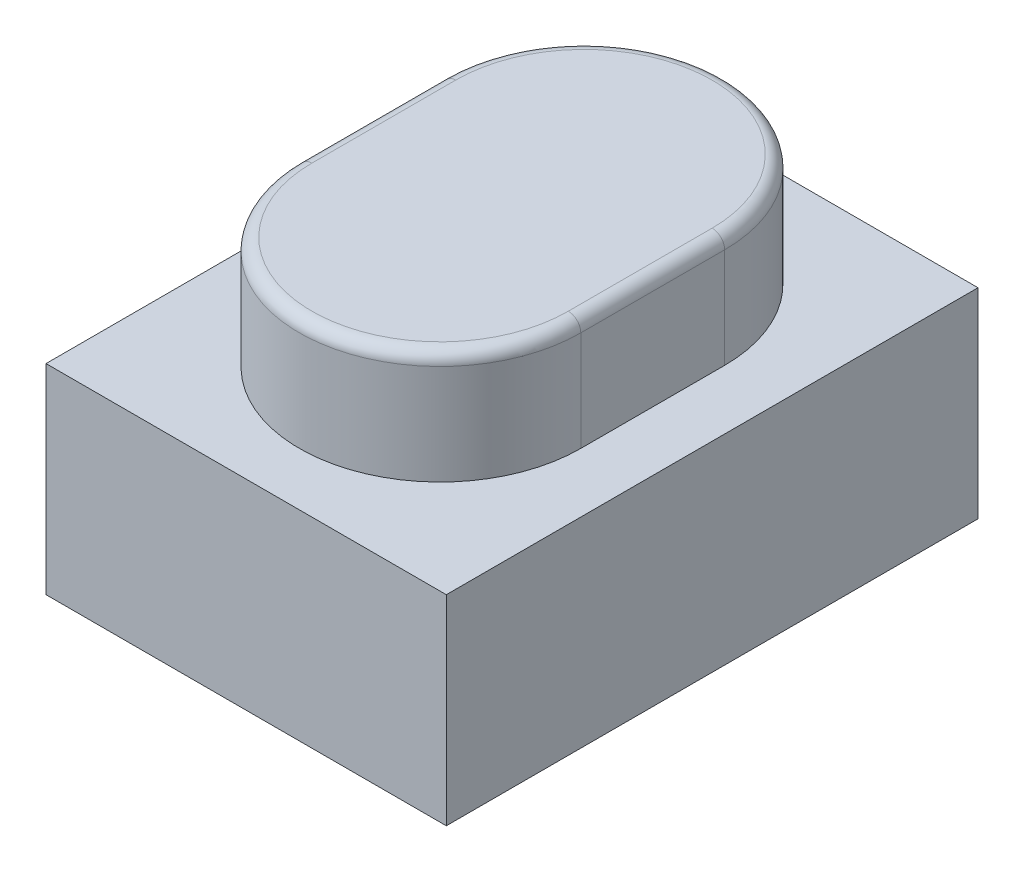
ISO-10303-21;
HEADER;
FILE_DESCRIPTION(('STEP AP214'),'2;1');
FILE_NAME('part.step','',(''),(''),'','','');
FILE_SCHEMA(('AUTOMOTIVE_DESIGN { 1 0 10303 214 1 1 1 1 }'));
ENDSEC;
DATA;
#1=APPLICATION_CONTEXT('core data for automotive mechanical design processes');
#2=APPLICATION_PROTOCOL_DEFINITION('international standard','automotive_design',2000,#1);
#3=PRODUCT_CONTEXT('',#1,'mechanical');
#4=PRODUCT('Part','Part','',(#3));
#5=PRODUCT_RELATED_PRODUCT_CATEGORY('part','',(#4));
#6=PRODUCT_DEFINITION_FORMATION('','',#4);
#7=PRODUCT_DEFINITION_CONTEXT('part definition',#1,'design');
#8=PRODUCT_DEFINITION('design','',#6,#7);
#9=PRODUCT_DEFINITION_SHAPE('','',#8);
#10=(LENGTH_UNIT() NAMED_UNIT(*) SI_UNIT(.MILLI.,.METRE.));
#11=(NAMED_UNIT(*) PLANE_ANGLE_UNIT() SI_UNIT($,.RADIAN.));
#12=(NAMED_UNIT(*) SI_UNIT($,.STERADIAN.) SOLID_ANGLE_UNIT());
#13=UNCERTAINTY_MEASURE_WITH_UNIT(LENGTH_MEASURE(1.E-05),#10,'distance_accuracy_value','');
#14=(GEOMETRIC_REPRESENTATION_CONTEXT(3) GLOBAL_UNCERTAINTY_ASSIGNED_CONTEXT((#13)) GLOBAL_UNIT_ASSIGNED_CONTEXT((#10,
#11,#12)) REPRESENTATION_CONTEXT('',''));
#15=CARTESIAN_POINT('',(0.,0.,0.));
#16=DIRECTION('',(0.,0.,1.));
#17=DIRECTION('',(1.,0.,0.));
#18=AXIS2_PLACEMENT_3D('',#15,#16,#17);
#19=CARTESIAN_POINT('',(1.6,1.6,-2.125));
#20=DIRECTION('',(-1.,0.,0.));
#21=DIRECTION('',(0.,0.,1.));
#22=AXIS2_PLACEMENT_3D('',#19,#20,#21);
#23=PLANE('',#22);
#24=DIRECTION('',(0.,0.,-1.));
#25=VECTOR('',#24,1.);
#26=CARTESIAN_POINT('',(1.6,0.,-2.125));
#27=LINE('',#26,#25);
#28=CARTESIAN_POINT('',(1.6,0.,2.125));
#29=VERTEX_POINT('',#28);
#30=CARTESIAN_POINT('',(1.6,0.,-2.125));
#31=VERTEX_POINT('',#30);
#32=EDGE_CURVE('E144',#29,#31,#27,.T.);
#33=ORIENTED_EDGE('',*,*,#32,.T.);
#34=DIRECTION('',(0.,-1.,0.));
#35=VECTOR('',#34,1.);
#36=CARTESIAN_POINT('',(1.6,1.6,-2.125));
#37=LINE('',#36,#35);
#38=CARTESIAN_POINT('',(1.6,1.6,-2.125));
#39=VERTEX_POINT('',#38);
#40=EDGE_CURVE('E171',#39,#31,#37,.T.);
#41=ORIENTED_EDGE('',*,*,#40,.F.);
#42=DIRECTION('',(0.,0.,-1.));
#43=VECTOR('',#42,1.);
#44=CARTESIAN_POINT('',(1.6,1.6,-2.125));
#45=LINE('',#44,#43);
#46=CARTESIAN_POINT('',(1.6,1.6,2.125));
#47=VERTEX_POINT('',#46);
#48=EDGE_CURVE('E145',#47,#39,#45,.T.);
#49=ORIENTED_EDGE('',*,*,#48,.F.);
#50=DIRECTION('',(0.,-1.,0.));
#51=VECTOR('',#50,1.);
#52=CARTESIAN_POINT('',(1.6,1.6,2.125));
#53=LINE('',#52,#51);
#54=EDGE_CURVE('E155',#47,#29,#53,.T.);
#55=ORIENTED_EDGE('',*,*,#54,.T.);
#56=EDGE_LOOP('',(#33,#41,#49,#55));
#57=FACE_BOUND('',#56,.T.);
#58=ADVANCED_FACE('F39',(#57),#23,.F.);
#59=CARTESIAN_POINT('',(-1.6,1.6,-2.125));
#60=DIRECTION('',(0.,0.,1.));
#61=DIRECTION('',(1.,0.,0.));
#62=AXIS2_PLACEMENT_3D('',#59,#60,#61);
#63=PLANE('',#62);
#64=DIRECTION('',(-1.,0.,0.));
#65=VECTOR('',#64,1.);
#66=CARTESIAN_POINT('',(-1.6,0.,-2.125));
#67=LINE('',#66,#65);
#68=CARTESIAN_POINT('',(-1.6,0.,-2.125));
#69=VERTEX_POINT('',#68);
#70=EDGE_CURVE('E158',#31,#69,#67,.T.);
#71=ORIENTED_EDGE('',*,*,#70,.T.);
#72=DIRECTION('',(0.,-1.,0.));
#73=VECTOR('',#72,1.);
#74=CARTESIAN_POINT('',(-1.6,1.6,-2.125));
#75=LINE('',#74,#73);
#76=CARTESIAN_POINT('',(-1.6,1.6,-2.125));
#77=VERTEX_POINT('',#76);
#78=EDGE_CURVE('E168',#77,#69,#75,.T.);
#79=ORIENTED_EDGE('',*,*,#78,.F.);
#80=DIRECTION('',(-1.,0.,0.));
#81=VECTOR('',#80,1.);
#82=CARTESIAN_POINT('',(-1.6,1.6,-2.125));
#83=LINE('',#82,#81);
#84=EDGE_CURVE('E148',#39,#77,#83,.T.);
#85=ORIENTED_EDGE('',*,*,#84,.F.);
#86=ORIENTED_EDGE('',*,*,#40,.T.);
#87=EDGE_LOOP('',(#71,#79,#85,#86));
#88=FACE_BOUND('',#87,.T.);
#89=ADVANCED_FACE('F226',(#88),#63,.F.);
#90=CARTESIAN_POINT('',(-1.6,1.6,-2.125));
#91=DIRECTION('',(1.,0.,0.));
#92=DIRECTION('',(0.,0.,-1.));
#93=AXIS2_PLACEMENT_3D('',#90,#91,#92);
#94=PLANE('',#93);
#95=DIRECTION('',(0.,0.,1.));
#96=VECTOR('',#95,1.);
#97=CARTESIAN_POINT('',(-1.6,0.,-2.125));
#98=LINE('',#97,#96);
#99=CARTESIAN_POINT('',(-1.6,0.,2.125));
#100=VERTEX_POINT('',#99);
#101=EDGE_CURVE('E160',#69,#100,#98,.T.);
#102=ORIENTED_EDGE('',*,*,#101,.T.);
#103=DIRECTION('',(0.,-1.,0.));
#104=VECTOR('',#103,1.);
#105=CARTESIAN_POINT('',(-1.6,1.6,2.125));
#106=LINE('',#105,#104);
#107=CARTESIAN_POINT('',(-1.6,1.6,2.125));
#108=VERTEX_POINT('',#107);
#109=EDGE_CURVE('E165',#108,#100,#106,.T.);
#110=ORIENTED_EDGE('',*,*,#109,.F.);
#111=DIRECTION('',(0.,0.,1.));
#112=VECTOR('',#111,1.);
#113=CARTESIAN_POINT('',(-1.6,1.6,-2.125));
#114=LINE('',#113,#112);
#115=EDGE_CURVE('E151',#77,#108,#114,.T.);
#116=ORIENTED_EDGE('',*,*,#115,.F.);
#117=ORIENTED_EDGE('',*,*,#78,.T.);
#118=EDGE_LOOP('',(#102,#110,#116,#117));
#119=FACE_BOUND('',#118,.T.);
#120=ADVANCED_FACE('F232',(#119),#94,.F.);
#121=CARTESIAN_POINT('',(-1.6,1.6,2.125));
#122=DIRECTION('',(0.,0.,-1.));
#123=DIRECTION('',(-1.,0.,0.));
#124=AXIS2_PLACEMENT_3D('',#121,#122,#123);
#125=PLANE('',#124);
#126=DIRECTION('',(1.,0.,0.));
#127=VECTOR('',#126,1.);
#128=CARTESIAN_POINT('',(-1.6,0.,2.125));
#129=LINE('',#128,#127);
#130=EDGE_CURVE('E149',#100,#29,#129,.T.);
#131=ORIENTED_EDGE('',*,*,#130,.T.);
#132=ORIENTED_EDGE('',*,*,#54,.F.);
#133=DIRECTION('',(1.,0.,0.));
#134=VECTOR('',#133,1.);
#135=CARTESIAN_POINT('',(-1.6,1.6,2.125));
#136=LINE('',#135,#134);
#137=EDGE_CURVE('E153',#108,#47,#136,.T.);
#138=ORIENTED_EDGE('',*,*,#137,.F.);
#139=ORIENTED_EDGE('',*,*,#109,.T.);
#140=EDGE_LOOP('',(#131,#132,#138,#139));
#141=FACE_BOUND('',#140,.T.);
#142=ADVANCED_FACE('F313',(#141),#125,.F.);
#143=CARTESIAN_POINT('',(0.,1.6,0.));
#144=DIRECTION('',(0.,1.,0.));
#145=DIRECTION('',(0.,0.,1.));
#146=AXIS2_PLACEMENT_3D('',#143,#144,#145);
#147=PLANE('',#146);
#148=CARTESIAN_POINT('',(0.,1.6,-0.575));
#149=DIRECTION('',(0.,1.,0.));
#150=DIRECTION('',(0.,0.,1.));
#151=AXIS2_PLACEMENT_3D('',#148,#149,#150);
#152=CIRCLE('',#151,1.125);
#153=CARTESIAN_POINT('',(1.125,1.6,-0.575000000000001));
#154=VERTEX_POINT('',#153);
#155=CARTESIAN_POINT('',(-1.125,1.6,-0.575));
#156=VERTEX_POINT('',#155);
#157=EDGE_CURVE('E135',#154,#156,#152,.T.);
#158=ORIENTED_EDGE('',*,*,#157,.F.);
#159=DIRECTION('',(0.,0.,-1.));
#160=VECTOR('',#159,1.);
#161=CARTESIAN_POINT('',(1.125,1.6,-0.575000000000001));
#162=LINE('',#161,#160);
#163=CARTESIAN_POINT('',(1.125,1.6,0.575));
#164=VERTEX_POINT('',#163);
#165=EDGE_CURVE('E132',#164,#154,#162,.T.);
#166=ORIENTED_EDGE('',*,*,#165,.F.);
#167=CARTESIAN_POINT('',(0.,1.6,0.575));
#168=DIRECTION('',(0.,1.,0.));
#169=DIRECTION('',(0.,0.,1.));
#170=AXIS2_PLACEMENT_3D('',#167,#168,#169);
#171=CIRCLE('',#170,1.125);
#172=CARTESIAN_POINT('',(-1.125,1.6,0.575));
#173=VERTEX_POINT('',#172);
#174=EDGE_CURVE('E118',#173,#164,#171,.T.);
#175=ORIENTED_EDGE('',*,*,#174,.F.);
#176=DIRECTION('',(0.,0.,1.));
#177=VECTOR('',#176,1.);
#178=CARTESIAN_POINT('',(-1.125,1.6,-0.575));
#179=LINE('',#178,#177);
#180=EDGE_CURVE('E129',#156,#173,#179,.T.);
#181=ORIENTED_EDGE('',*,*,#180,.F.);
#182=EDGE_LOOP('',(#158,#166,#175,#181));
#183=FACE_BOUND('',#182,.T.);
#184=ORIENTED_EDGE('',*,*,#48,.T.);
#185=ORIENTED_EDGE('',*,*,#84,.T.);
#186=ORIENTED_EDGE('',*,*,#115,.T.);
#187=ORIENTED_EDGE('',*,*,#137,.T.);
#188=EDGE_LOOP('',(#184,#185,#186,#187));
#189=FACE_BOUND('',#188,.T.);
#190=ADVANCED_FACE('F127',(#183,#189),#147,.T.);
#191=CARTESIAN_POINT('',(0.,0.,0.));
#192=DIRECTION('',(0.,1.,0.));
#193=DIRECTION('',(0.,0.,1.));
#194=AXIS2_PLACEMENT_3D('',#191,#192,#193);
#195=PLANE('',#194);
#196=ORIENTED_EDGE('',*,*,#32,.F.);
#197=ORIENTED_EDGE('',*,*,#130,.F.);
#198=ORIENTED_EDGE('',*,*,#101,.F.);
#199=ORIENTED_EDGE('',*,*,#70,.F.);
#200=EDGE_LOOP('',(#196,#197,#198,#199));
#201=FACE_BOUND('',#200,.T.);
#202=ADVANCED_FACE('F302',(#201),#195,.F.);
#203=CARTESIAN_POINT('',(0.,2.5,-0.575));
#204=DIRECTION('',(0.,-1.,0.));
#205=DIRECTION('',(0.,0.,-1.));
#206=AXIS2_PLACEMENT_3D('',#203,#204,#205);
#207=CYLINDRICAL_SURFACE('',#206,1.125);
#208=DIRECTION('',(0.,-1.,0.));
#209=VECTOR('',#208,1.);
#210=CARTESIAN_POINT('',(-1.125,2.5,-0.575));
#211=LINE('',#210,#209);
#212=CARTESIAN_POINT('',(-1.125,2.4,-0.575));
#213=VERTEX_POINT('',#212);
#214=EDGE_CURVE('E120',#213,#156,#211,.T.);
#215=ORIENTED_EDGE('',*,*,#214,.F.);
#216=CARTESIAN_POINT('',(0.,2.4,-0.575));
#217=DIRECTION('',(0.,1.,0.));
#218=DIRECTION('',(0.,0.,1.));
#219=AXIS2_PLACEMENT_3D('',#216,#217,#218);
#220=CIRCLE('',#219,1.125);
#221=CARTESIAN_POINT('',(1.125,2.4,-0.575000000000001));
#222=VERTEX_POINT('',#221);
#223=EDGE_CURVE('E11',#213,#222,#220,.F.);
#224=ORIENTED_EDGE('',*,*,#223,.T.);
#225=DIRECTION('',(0.,-1.,0.));
#226=VECTOR('',#225,1.);
#227=CARTESIAN_POINT('',(1.125,2.5,-0.575000000000001));
#228=LINE('',#227,#226);
#229=EDGE_CURVE('E140',#222,#154,#228,.T.);
#230=ORIENTED_EDGE('',*,*,#229,.T.);
#231=ORIENTED_EDGE('',*,*,#157,.T.);
#232=EDGE_LOOP('',(#215,#224,#230,#231));
#233=FACE_BOUND('',#232,.T.);
#234=ADVANCED_FACE('F209',(#233),#207,.T.);
#235=CARTESIAN_POINT('',(-1.125,2.5,-0.575));
#236=DIRECTION('',(1.,0.,0.));
#237=DIRECTION('',(0.,0.,-1.));
#238=AXIS2_PLACEMENT_3D('',#235,#236,#237);
#239=PLANE('',#238);
#240=DIRECTION('',(0.,-1.,0.));
#241=VECTOR('',#240,1.);
#242=CARTESIAN_POINT('',(-1.125,2.5,0.575));
#243=LINE('',#242,#241);
#244=CARTESIAN_POINT('',(-1.125,2.4,0.575));
#245=VERTEX_POINT('',#244);
#246=EDGE_CURVE('E115',#245,#173,#243,.T.);
#247=ORIENTED_EDGE('',*,*,#246,.F.);
#248=DIRECTION('',(0.,0.,1.));
#249=VECTOR('',#248,1.);
#250=CARTESIAN_POINT('',(-1.125,2.4,-0.575));
#251=LINE('',#250,#249);
#252=EDGE_CURVE('E48',#245,#213,#251,.F.);
#253=ORIENTED_EDGE('',*,*,#252,.T.);
#254=ORIENTED_EDGE('',*,*,#214,.T.);
#255=ORIENTED_EDGE('',*,*,#180,.T.);
#256=EDGE_LOOP('',(#247,#253,#254,#255));
#257=FACE_BOUND('',#256,.T.);
#258=ADVANCED_FACE('F134',(#257),#239,.F.);
#259=CARTESIAN_POINT('',(0.,2.5,0.575));
#260=DIRECTION('',(0.,-1.,0.));
#261=DIRECTION('',(0.,0.,-1.));
#262=AXIS2_PLACEMENT_3D('',#259,#260,#261);
#263=CYLINDRICAL_SURFACE('',#262,1.125);
#264=DIRECTION('',(0.,-1.,0.));
#265=VECTOR('',#264,1.);
#266=CARTESIAN_POINT('',(1.125,2.5,0.575));
#267=LINE('',#266,#265);
#268=CARTESIAN_POINT('',(1.125,2.4,0.575));
#269=VERTEX_POINT('',#268);
#270=EDGE_CURVE('E121',#269,#164,#267,.T.);
#271=ORIENTED_EDGE('',*,*,#270,.F.);
#272=CARTESIAN_POINT('',(0.,2.4,0.575));
#273=DIRECTION('',(0.,1.,0.));
#274=DIRECTION('',(0.,0.,1.));
#275=AXIS2_PLACEMENT_3D('',#272,#273,#274);
#276=CIRCLE('',#275,1.125);
#277=EDGE_CURVE('E63',#269,#245,#276,.F.);
#278=ORIENTED_EDGE('',*,*,#277,.T.);
#279=ORIENTED_EDGE('',*,*,#246,.T.);
#280=ORIENTED_EDGE('',*,*,#174,.T.);
#281=EDGE_LOOP('',(#271,#278,#279,#280));
#282=FACE_BOUND('',#281,.T.);
#283=ADVANCED_FACE('F117',(#282),#263,.T.);
#284=CARTESIAN_POINT('',(1.125,2.5,-0.575000000000001));
#285=DIRECTION('',(-1.,0.,0.));
#286=DIRECTION('',(0.,0.,1.));
#287=AXIS2_PLACEMENT_3D('',#284,#285,#286);
#288=PLANE('',#287);
#289=ORIENTED_EDGE('',*,*,#229,.F.);
#290=DIRECTION('',(0.,0.,-1.));
#291=VECTOR('',#290,1.);
#292=CARTESIAN_POINT('',(1.125,2.4,0.575));
#293=LINE('',#292,#291);
#294=EDGE_CURVE('E183',#222,#269,#293,.F.);
#295=ORIENTED_EDGE('',*,*,#294,.T.);
#296=ORIENTED_EDGE('',*,*,#270,.T.);
#297=ORIENTED_EDGE('',*,*,#165,.T.);
#298=EDGE_LOOP('',(#289,#295,#296,#297));
#299=FACE_BOUND('',#298,.T.);
#300=ADVANCED_FACE('F212',(#299),#288,.F.);
#301=CARTESIAN_POINT('',(0.,2.5,-0.575));
#302=DIRECTION('',(0.,1.,0.));
#303=DIRECTION('',(0.,0.,1.));
#304=AXIS2_PLACEMENT_3D('',#301,#302,#303);
#305=PLANE('',#304);
#306=CARTESIAN_POINT('',(0.,2.5,0.575));
#307=DIRECTION('',(0.,1.,0.));
#308=DIRECTION('',(0.,0.,1.));
#309=AXIS2_PLACEMENT_3D('',#306,#307,#308);
#310=CIRCLE('',#309,1.025);
#311=CARTESIAN_POINT('',(-1.025,2.5,0.575));
#312=VERTEX_POINT('',#311);
#313=CARTESIAN_POINT('',(1.025,2.5,0.575));
#314=VERTEX_POINT('',#313);
#315=EDGE_CURVE('E178',#312,#314,#310,.T.);
#316=ORIENTED_EDGE('',*,*,#315,.T.);
#317=DIRECTION('',(0.,0.,-1.));
#318=VECTOR('',#317,1.);
#319=CARTESIAN_POINT('',(1.025,2.5,-0.575000000000001));
#320=LINE('',#319,#318);
#321=CARTESIAN_POINT('',(1.025,2.5,-0.575000000000001));
#322=VERTEX_POINT('',#321);
#323=EDGE_CURVE('E180',#314,#322,#320,.T.);
#324=ORIENTED_EDGE('',*,*,#323,.T.);
#325=CARTESIAN_POINT('',(0.,2.5,-0.575));
#326=DIRECTION('',(0.,1.,0.));
#327=DIRECTION('',(0.,0.,1.));
#328=AXIS2_PLACEMENT_3D('',#325,#326,#327);
#329=CIRCLE('',#328,1.025);
#330=CARTESIAN_POINT('',(-1.025,2.5,-0.575));
#331=VERTEX_POINT('',#330);
#332=EDGE_CURVE('E174',#322,#331,#329,.T.);
#333=ORIENTED_EDGE('',*,*,#332,.T.);
#334=DIRECTION('',(0.,0.,1.));
#335=VECTOR('',#334,1.);
#336=CARTESIAN_POINT('',(-1.025,2.5,0.575));
#337=LINE('',#336,#335);
#338=EDGE_CURVE('E176',#331,#312,#337,.T.);
#339=ORIENTED_EDGE('',*,*,#338,.T.);
#340=EDGE_LOOP('',(#316,#324,#333,#339));
#341=FACE_BOUND('',#340,.T.);
#342=ADVANCED_FACE('F217',(#341),#305,.T.);
#343=CARTESIAN_POINT('',(-1.025,2.4,-0.575));
#344=DIRECTION('',(0.,0.,-1.));
#345=DIRECTION('',(-1.,0.,0.));
#346=AXIS2_PLACEMENT_3D('',#343,#344,#345);
#347=CYLINDRICAL_SURFACE('',#346,0.1);
#348=CARTESIAN_POINT('',(-1.025,2.4,-0.575));
#349=DIRECTION('',(0.,0.,-1.));
#350=DIRECTION('',(-1.,0.,0.));
#351=AXIS2_PLACEMENT_3D('',#348,#349,#350);
#352=CIRCLE('',#351,0.1);
#353=EDGE_CURVE('E191',#213,#331,#352,.T.);
#354=ORIENTED_EDGE('',*,*,#353,.F.);
#355=ORIENTED_EDGE('',*,*,#252,.F.);
#356=CARTESIAN_POINT('',(-1.025,2.4,0.575));
#357=DIRECTION('',(0.,0.,1.));
#358=DIRECTION('',(1.,0.,0.));
#359=AXIS2_PLACEMENT_3D('',#356,#357,#358);
#360=CIRCLE('',#359,0.1);
#361=EDGE_CURVE('E43',#312,#245,#360,.T.);
#362=ORIENTED_EDGE('',*,*,#361,.F.);
#363=ORIENTED_EDGE('',*,*,#338,.F.);
#364=EDGE_LOOP('',(#354,#355,#362,#363));
#365=FACE_BOUND('',#364,.T.);
#366=ADVANCED_FACE('F41',(#365),#347,.T.);
#367=CARTESIAN_POINT('',(0.,2.4,0.575));
#368=DIRECTION('',(0.,1.,0.));
#369=DIRECTION('',(0.,0.,1.));
#370=AXIS2_PLACEMENT_3D('',#367,#368,#369);
#371=TOROIDAL_SURFACE('',#370,1.025,0.1);
#372=ORIENTED_EDGE('',*,*,#361,.T.);
#373=ORIENTED_EDGE('',*,*,#277,.F.);
#374=CARTESIAN_POINT('',(1.025,2.4,0.575));
#375=DIRECTION('',(0.,0.,-1.));
#376=DIRECTION('',(-1.,0.,0.));
#377=AXIS2_PLACEMENT_3D('',#374,#375,#376);
#378=CIRCLE('',#377,0.1);
#379=EDGE_CURVE('E190',#314,#269,#378,.T.);
#380=ORIENTED_EDGE('',*,*,#379,.F.);
#381=ORIENTED_EDGE('',*,*,#315,.F.);
#382=EDGE_LOOP('',(#372,#373,#380,#381));
#383=FACE_BOUND('',#382,.T.);
#384=ADVANCED_FACE('F201',(#383),#371,.T.);
#385=CARTESIAN_POINT('',(0.,2.4,-0.575));
#386=DIRECTION('',(0.,1.,0.));
#387=DIRECTION('',(0.,0.,1.));
#388=AXIS2_PLACEMENT_3D('',#385,#386,#387);
#389=TOROIDAL_SURFACE('',#388,1.025,0.1);
#390=ORIENTED_EDGE('',*,*,#353,.T.);
#391=ORIENTED_EDGE('',*,*,#332,.F.);
#392=CARTESIAN_POINT('',(1.025,2.4,-0.575000000000001));
#393=DIRECTION('',(0.,0.,1.));
#394=DIRECTION('',(1.,0.,0.));
#395=AXIS2_PLACEMENT_3D('',#392,#393,#394);
#396=CIRCLE('',#395,0.1);
#397=EDGE_CURVE('E188',#222,#322,#396,.T.);
#398=ORIENTED_EDGE('',*,*,#397,.F.);
#399=ORIENTED_EDGE('',*,*,#223,.F.);
#400=EDGE_LOOP('',(#390,#391,#398,#399));
#401=FACE_BOUND('',#400,.T.);
#402=ADVANCED_FACE('F206',(#401),#389,.T.);
#403=CARTESIAN_POINT('',(1.025,2.4,-0.575));
#404=DIRECTION('',(0.,0.,1.));
#405=DIRECTION('',(1.,0.,0.));
#406=AXIS2_PLACEMENT_3D('',#403,#404,#405);
#407=CYLINDRICAL_SURFACE('',#406,0.1);
#408=ORIENTED_EDGE('',*,*,#379,.T.);
#409=ORIENTED_EDGE('',*,*,#294,.F.);
#410=ORIENTED_EDGE('',*,*,#397,.T.);
#411=ORIENTED_EDGE('',*,*,#323,.F.);
#412=EDGE_LOOP('',(#408,#409,#410,#411));
#413=FACE_BOUND('',#412,.T.);
#414=ADVANCED_FACE('F214',(#413),#407,.T.);
#415=CLOSED_SHELL('',(#58,#89,#120,#142,#190,#202,#234,#258,#283,#300,#342,#366,#384,#402,#414));
#416=MANIFOLD_SOLID_BREP('B2',#415);
#417=ADVANCED_BREP_SHAPE_REPRESENTATION('',(#18,#416),#14);
#418=SHAPE_DEFINITION_REPRESENTATION(#9,#417);
ENDSEC;
END-ISO-10303-21;
